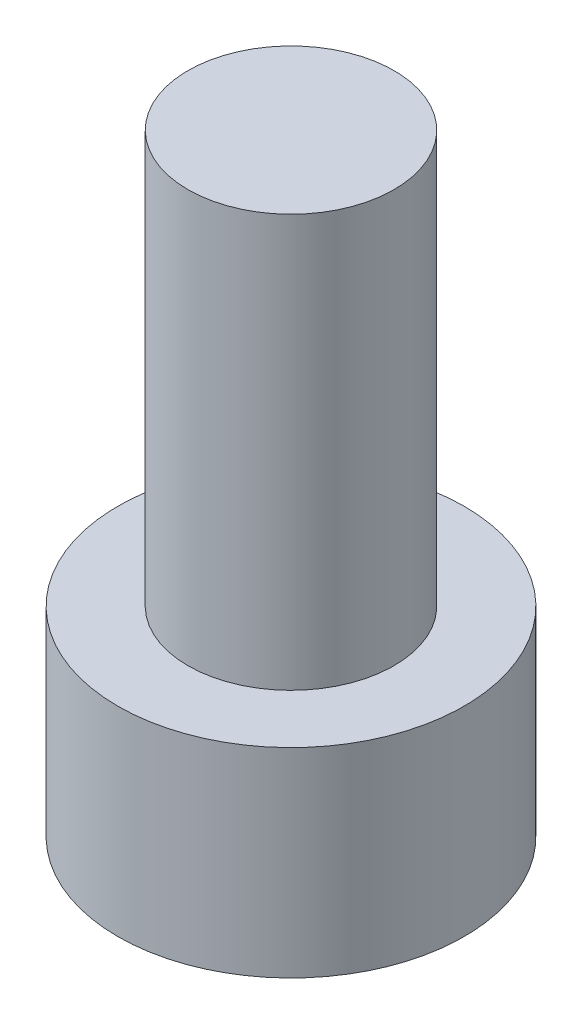
ISO-10303-21;
HEADER;
FILE_DESCRIPTION(('STEP AP214'),'2;1');
FILE_NAME('part.step','',(''),(''),'','','');
FILE_SCHEMA(('AUTOMOTIVE_DESIGN { 1 0 10303 214 1 1 1 1 }'));
ENDSEC;
DATA;
#1=APPLICATION_CONTEXT('core data for automotive mechanical design processes');
#2=APPLICATION_PROTOCOL_DEFINITION('international standard','automotive_design',2000,#1);
#3=PRODUCT_CONTEXT('',#1,'mechanical');
#4=PRODUCT('Part','Part','',(#3));
#5=PRODUCT_RELATED_PRODUCT_CATEGORY('part','',(#4));
#6=PRODUCT_DEFINITION_FORMATION('','',#4);
#7=PRODUCT_DEFINITION_CONTEXT('part definition',#1,'design');
#8=PRODUCT_DEFINITION('design','',#6,#7);
#9=PRODUCT_DEFINITION_SHAPE('','',#8);
#10=(LENGTH_UNIT() NAMED_UNIT(*) SI_UNIT(.MILLI.,.METRE.));
#11=(NAMED_UNIT(*) PLANE_ANGLE_UNIT() SI_UNIT($,.RADIAN.));
#12=(NAMED_UNIT(*) SI_UNIT($,.STERADIAN.) SOLID_ANGLE_UNIT());
#13=UNCERTAINTY_MEASURE_WITH_UNIT(LENGTH_MEASURE(1.E-05),#10,'distance_accuracy_value','');
#14=(GEOMETRIC_REPRESENTATION_CONTEXT(3) GLOBAL_UNCERTAINTY_ASSIGNED_CONTEXT((#13)) GLOBAL_UNIT_ASSIGNED_CONTEXT((#10,
#11,#12)) REPRESENTATION_CONTEXT('',''));
#15=CARTESIAN_POINT('',(0.,0.,0.));
#16=DIRECTION('',(0.,0.,1.));
#17=DIRECTION('',(1.,0.,0.));
#18=AXIS2_PLACEMENT_3D('',#15,#16,#17);
#19=CARTESIAN_POINT('',(0.,4.84,0.));
#20=DIRECTION('',(0.,-1.,0.));
#21=DIRECTION('',(0.,0.,-1.));
#22=AXIS2_PLACEMENT_3D('',#19,#20,#21);
#23=CYLINDRICAL_SURFACE('',#22,4.2);
#24=CARTESIAN_POINT('',(0.,4.84,0.));
#25=DIRECTION('',(0.,1.,0.));
#26=DIRECTION('',(0.,0.,1.));
#27=AXIS2_PLACEMENT_3D('',#24,#25,#26);
#28=CIRCLE('',#27,4.2);
#29=CARTESIAN_POINT('',(0.,4.84,4.2));
#30=VERTEX_POINT('',#29);
#31=EDGE_CURVE('E43',#30,#30,#28,.T.);
#32=ORIENTED_EDGE('',*,*,#31,.F.);
#33=EDGE_LOOP('',(#32));
#34=FACE_BOUND('',#33,.T.);
#35=CARTESIAN_POINT('',(0.,0.,0.));
#36=DIRECTION('',(0.,1.,0.));
#37=DIRECTION('',(0.,0.,1.));
#38=AXIS2_PLACEMENT_3D('',#35,#36,#37);
#39=CIRCLE('',#38,4.2);
#40=CARTESIAN_POINT('',(0.,0.,4.2));
#41=VERTEX_POINT('',#40);
#42=EDGE_CURVE('E38',#41,#41,#39,.T.);
#43=ORIENTED_EDGE('',*,*,#42,.T.);
#44=EDGE_LOOP('',(#43));
#45=FACE_BOUND('',#44,.T.);
#46=ADVANCED_FACE('F35',(#34,#45),#23,.T.);
#47=CARTESIAN_POINT('',(0.,4.84,0.));
#48=DIRECTION('',(0.,1.,0.));
#49=DIRECTION('',(0.,0.,1.));
#50=AXIS2_PLACEMENT_3D('',#47,#48,#49);
#51=PLANE('',#50);
#52=CARTESIAN_POINT('',(0.,4.84,0.));
#53=DIRECTION('',(0.,1.,0.));
#54=DIRECTION('',(0.,0.,1.));
#55=AXIS2_PLACEMENT_3D('',#52,#53,#54);
#56=CIRCLE('',#55,2.5);
#57=CARTESIAN_POINT('',(0.,4.84,2.5));
#58=VERTEX_POINT('',#57);
#59=EDGE_CURVE('E11',#58,#58,#56,.T.);
#60=ORIENTED_EDGE('',*,*,#59,.F.);
#61=EDGE_LOOP('',(#60));
#62=FACE_BOUND('',#61,.T.);
#63=ORIENTED_EDGE('',*,*,#31,.T.);
#64=EDGE_LOOP('',(#63));
#65=FACE_BOUND('',#64,.T.);
#66=ADVANCED_FACE('F155',(#62,#65),#51,.T.);
#67=CARTESIAN_POINT('',(0.,0.,0.));
#68=DIRECTION('',(0.,1.,0.));
#69=DIRECTION('',(0.,0.,1.));
#70=AXIS2_PLACEMENT_3D('',#67,#68,#69);
#71=PLANE('',#70);
#72=DIRECTION('',(-0.5,0.,0.866025403784439));
#73=VECTOR('',#72,1.);
#74=CARTESIAN_POINT('',(2.3,0.,0.));
#75=LINE('',#74,#73);
#76=CARTESIAN_POINT('',(2.3,0.,0.));
#77=VERTEX_POINT('',#76);
#78=CARTESIAN_POINT('',(1.15,0.,1.99185842870421));
#79=VERTEX_POINT('',#78);
#80=EDGE_CURVE('E125',#77,#79,#75,.T.);
#81=ORIENTED_EDGE('',*,*,#80,.F.);
#82=DIRECTION('',(0.5,0.,0.866025403784439));
#83=VECTOR('',#82,1.);
#84=CARTESIAN_POINT('',(1.15,0.,-1.99185842870421));
#85=LINE('',#84,#83);
#86=CARTESIAN_POINT('',(1.15,0.,-1.99185842870421));
#87=VERTEX_POINT('',#86);
#88=EDGE_CURVE('E51',#87,#77,#85,.T.);
#89=ORIENTED_EDGE('',*,*,#88,.F.);
#90=DIRECTION('',(1.,0.,0.));
#91=VECTOR('',#90,1.);
#92=CARTESIAN_POINT('',(-1.15,0.,-1.99185842870421));
#93=LINE('',#92,#91);
#94=CARTESIAN_POINT('',(-1.15,0.,-1.99185842870421));
#95=VERTEX_POINT('',#94);
#96=EDGE_CURVE('E134',#95,#87,#93,.T.);
#97=ORIENTED_EDGE('',*,*,#96,.F.);
#98=DIRECTION('',(0.5,0.,-0.866025403784439));
#99=VECTOR('',#98,1.);
#100=CARTESIAN_POINT('',(-2.3,0.,0.));
#101=LINE('',#100,#99);
#102=CARTESIAN_POINT('',(-2.3,0.,0.));
#103=VERTEX_POINT('',#102);
#104=EDGE_CURVE('E132',#103,#95,#101,.T.);
#105=ORIENTED_EDGE('',*,*,#104,.F.);
#106=DIRECTION('',(-0.5,0.,-0.866025403784439));
#107=VECTOR('',#106,1.);
#108=CARTESIAN_POINT('',(-1.15,0.,1.99185842870421));
#109=LINE('',#108,#107);
#110=CARTESIAN_POINT('',(-1.15,0.,1.99185842870421));
#111=VERTEX_POINT('',#110);
#112=EDGE_CURVE('E99',#111,#103,#109,.T.);
#113=ORIENTED_EDGE('',*,*,#112,.F.);
#114=DIRECTION('',(-1.,0.,0.));
#115=VECTOR('',#114,1.);
#116=CARTESIAN_POINT('',(1.15,0.,1.99185842870421));
#117=LINE('',#116,#115);
#118=EDGE_CURVE('E128',#79,#111,#117,.T.);
#119=ORIENTED_EDGE('',*,*,#118,.F.);
#120=EDGE_LOOP('',(#81,#89,#97,#105,#113,#119));
#121=FACE_BOUND('',#120,.T.);
#122=ORIENTED_EDGE('',*,*,#42,.F.);
#123=EDGE_LOOP('',(#122));
#124=FACE_BOUND('',#123,.T.);
#125=ADVANCED_FACE('F152',(#121,#124),#71,.F.);
#126=CARTESIAN_POINT('',(0.,14.84,0.));
#127=DIRECTION('',(0.,-1.,0.));
#128=DIRECTION('',(0.,0.,-1.));
#129=AXIS2_PLACEMENT_3D('',#126,#127,#128);
#130=CYLINDRICAL_SURFACE('',#129,2.5);
#131=CARTESIAN_POINT('',(0.,14.84,0.));
#132=DIRECTION('',(0.,1.,0.));
#133=DIRECTION('',(0.,0.,1.));
#134=AXIS2_PLACEMENT_3D('',#131,#132,#133);
#135=CIRCLE('',#134,2.5);
#136=CARTESIAN_POINT('',(0.,14.84,2.5));
#137=VERTEX_POINT('',#136);
#138=EDGE_CURVE('E138',#137,#137,#135,.T.);
#139=ORIENTED_EDGE('',*,*,#138,.F.);
#140=EDGE_LOOP('',(#139));
#141=FACE_BOUND('',#140,.T.);
#142=ORIENTED_EDGE('',*,*,#59,.T.);
#143=EDGE_LOOP('',(#142));
#144=FACE_BOUND('',#143,.T.);
#145=ADVANCED_FACE('F154',(#141,#144),#130,.T.);
#146=CARTESIAN_POINT('',(0.,14.84,0.));
#147=DIRECTION('',(0.,1.,0.));
#148=DIRECTION('',(0.,0.,1.));
#149=AXIS2_PLACEMENT_3D('',#146,#147,#148);
#150=PLANE('',#149);
#151=ORIENTED_EDGE('',*,*,#138,.T.);
#152=EDGE_LOOP('',(#151));
#153=FACE_BOUND('',#152,.T.);
#154=ADVANCED_FACE('F161',(#153),#150,.T.);
#155=CARTESIAN_POINT('',(1.15,3.4,-1.99185842870421));
#156=DIRECTION('',(0.866025403784439,0.,-0.5));
#157=DIRECTION('',(-0.5,0.,-0.866025403784439));
#158=AXIS2_PLACEMENT_3D('',#155,#156,#157);
#159=PLANE('',#158);
#160=ORIENTED_EDGE('',*,*,#88,.T.);
#161=DIRECTION('',(0.,-1.,0.));
#162=VECTOR('',#161,1.);
#163=CARTESIAN_POINT('',(2.3,3.4,0.));
#164=LINE('',#163,#162);
#165=CARTESIAN_POINT('',(2.3,3.4,0.));
#166=VERTEX_POINT('',#165);
#167=EDGE_CURVE('E81',#166,#77,#164,.T.);
#168=ORIENTED_EDGE('',*,*,#167,.F.);
#169=DIRECTION('',(0.5,0.,0.866025403784439));
#170=VECTOR('',#169,1.);
#171=CARTESIAN_POINT('',(1.15,3.4,-1.99185842870421));
#172=LINE('',#171,#170);
#173=CARTESIAN_POINT('',(1.15,3.4,-1.99185842870421));
#174=VERTEX_POINT('',#173);
#175=EDGE_CURVE('E136',#174,#166,#172,.T.);
#176=ORIENTED_EDGE('',*,*,#175,.F.);
#177=DIRECTION('',(0.,-1.,0.));
#178=VECTOR('',#177,1.);
#179=CARTESIAN_POINT('',(1.15,3.4,-1.99185842870421));
#180=LINE('',#179,#178);
#181=EDGE_CURVE('E59',#174,#87,#180,.T.);
#182=ORIENTED_EDGE('',*,*,#181,.T.);
#183=EDGE_LOOP('',(#160,#168,#176,#182));
#184=FACE_BOUND('',#183,.T.);
#185=ADVANCED_FACE('F190',(#184),#159,.F.);
#186=CARTESIAN_POINT('',(-1.15,3.4,-1.99185842870421));
#187=DIRECTION('',(0.,0.,-1.));
#188=DIRECTION('',(-1.,0.,0.));
#189=AXIS2_PLACEMENT_3D('',#186,#187,#188);
#190=PLANE('',#189);
#191=ORIENTED_EDGE('',*,*,#96,.T.);
#192=ORIENTED_EDGE('',*,*,#181,.F.);
#193=DIRECTION('',(1.,0.,0.));
#194=VECTOR('',#193,1.);
#195=CARTESIAN_POINT('',(-1.15,3.4,-1.99185842870421));
#196=LINE('',#195,#194);
#197=CARTESIAN_POINT('',(-1.15,3.4,-1.99185842870421));
#198=VERTEX_POINT('',#197);
#199=EDGE_CURVE('E111',#198,#174,#196,.T.);
#200=ORIENTED_EDGE('',*,*,#199,.F.);
#201=DIRECTION('',(0.,-1.,0.));
#202=VECTOR('',#201,1.);
#203=CARTESIAN_POINT('',(-1.15,3.4,-1.99185842870421));
#204=LINE('',#203,#202);
#205=EDGE_CURVE('E103',#198,#95,#204,.T.);
#206=ORIENTED_EDGE('',*,*,#205,.T.);
#207=EDGE_LOOP('',(#191,#192,#200,#206));
#208=FACE_BOUND('',#207,.T.);
#209=ADVANCED_FACE('F204',(#208),#190,.F.);
#210=CARTESIAN_POINT('',(-2.3,3.4,0.));
#211=DIRECTION('',(-0.866025403784439,0.,-0.5));
#212=DIRECTION('',(-0.5,0.,0.866025403784439));
#213=AXIS2_PLACEMENT_3D('',#210,#211,#212);
#214=PLANE('',#213);
#215=ORIENTED_EDGE('',*,*,#104,.T.);
#216=ORIENTED_EDGE('',*,*,#205,.F.);
#217=DIRECTION('',(0.5,0.,-0.866025403784439));
#218=VECTOR('',#217,1.);
#219=CARTESIAN_POINT('',(-2.3,3.4,0.));
#220=LINE('',#219,#218);
#221=CARTESIAN_POINT('',(-2.3,3.4,0.));
#222=VERTEX_POINT('',#221);
#223=EDGE_CURVE('E107',#222,#198,#220,.T.);
#224=ORIENTED_EDGE('',*,*,#223,.F.);
#225=DIRECTION('',(0.,-1.,0.));
#226=VECTOR('',#225,1.);
#227=CARTESIAN_POINT('',(-2.3,3.4,0.));
#228=LINE('',#227,#226);
#229=EDGE_CURVE('E92',#222,#103,#228,.T.);
#230=ORIENTED_EDGE('',*,*,#229,.T.);
#231=EDGE_LOOP('',(#215,#216,#224,#230));
#232=FACE_BOUND('',#231,.T.);
#233=ADVANCED_FACE('F108',(#232),#214,.F.);
#234=CARTESIAN_POINT('',(-1.15,3.4,1.99185842870421));
#235=DIRECTION('',(-0.866025403784439,0.,0.5));
#236=DIRECTION('',(0.5,0.,0.866025403784439));
#237=AXIS2_PLACEMENT_3D('',#234,#235,#236);
#238=PLANE('',#237);
#239=ORIENTED_EDGE('',*,*,#112,.T.);
#240=ORIENTED_EDGE('',*,*,#229,.F.);
#241=DIRECTION('',(-0.5,0.,-0.866025403784439));
#242=VECTOR('',#241,1.);
#243=CARTESIAN_POINT('',(-1.15,3.4,1.99185842870421));
#244=LINE('',#243,#242);
#245=CARTESIAN_POINT('',(-1.15,3.4,1.99185842870421));
#246=VERTEX_POINT('',#245);
#247=EDGE_CURVE('E96',#246,#222,#244,.T.);
#248=ORIENTED_EDGE('',*,*,#247,.F.);
#249=DIRECTION('',(0.,-1.,0.));
#250=VECTOR('',#249,1.);
#251=CARTESIAN_POINT('',(-1.15,3.4,1.99185842870421));
#252=LINE('',#251,#250);
#253=EDGE_CURVE('E104',#246,#111,#252,.T.);
#254=ORIENTED_EDGE('',*,*,#253,.T.);
#255=EDGE_LOOP('',(#239,#240,#248,#254));
#256=FACE_BOUND('',#255,.T.);
#257=ADVANCED_FACE('F94',(#256),#238,.F.);
#258=CARTESIAN_POINT('',(1.15,3.4,1.99185842870421));
#259=DIRECTION('',(0.,0.,1.));
#260=DIRECTION('',(1.,0.,0.));
#261=AXIS2_PLACEMENT_3D('',#258,#259,#260);
#262=PLANE('',#261);
#263=ORIENTED_EDGE('',*,*,#118,.T.);
#264=ORIENTED_EDGE('',*,*,#253,.F.);
#265=DIRECTION('',(-1.,0.,0.));
#266=VECTOR('',#265,1.);
#267=CARTESIAN_POINT('',(1.15,3.4,1.99185842870421));
#268=LINE('',#267,#266);
#269=CARTESIAN_POINT('',(1.15,3.4,1.99185842870421));
#270=VERTEX_POINT('',#269);
#271=EDGE_CURVE('E117',#270,#246,#268,.T.);
#272=ORIENTED_EDGE('',*,*,#271,.F.);
#273=DIRECTION('',(0.,-1.,0.));
#274=VECTOR('',#273,1.);
#275=CARTESIAN_POINT('',(1.15,3.4,1.99185842870421));
#276=LINE('',#275,#274);
#277=EDGE_CURVE('E141',#270,#79,#276,.T.);
#278=ORIENTED_EDGE('',*,*,#277,.T.);
#279=EDGE_LOOP('',(#263,#264,#272,#278));
#280=FACE_BOUND('',#279,.T.);
#281=ADVANCED_FACE('F229',(#280),#262,.F.);
#282=CARTESIAN_POINT('',(2.3,3.4,0.));
#283=DIRECTION('',(0.866025403784439,0.,0.5));
#284=DIRECTION('',(0.5,0.,-0.866025403784439));
#285=AXIS2_PLACEMENT_3D('',#282,#283,#284);
#286=PLANE('',#285);
#287=ORIENTED_EDGE('',*,*,#80,.T.);
#288=ORIENTED_EDGE('',*,*,#277,.F.);
#289=DIRECTION('',(-0.5,0.,0.866025403784439));
#290=VECTOR('',#289,1.);
#291=CARTESIAN_POINT('',(2.3,3.4,0.));
#292=LINE('',#291,#290);
#293=EDGE_CURVE('E119',#166,#270,#292,.T.);
#294=ORIENTED_EDGE('',*,*,#293,.F.);
#295=ORIENTED_EDGE('',*,*,#167,.T.);
#296=EDGE_LOOP('',(#287,#288,#294,#295));
#297=FACE_BOUND('',#296,.T.);
#298=ADVANCED_FACE('F238',(#297),#286,.F.);
#299=CARTESIAN_POINT('',(0.,3.4,0.));
#300=DIRECTION('',(0.,-1.,0.));
#301=DIRECTION('',(0.,0.,-1.));
#302=AXIS2_PLACEMENT_3D('',#299,#300,#301);
#303=PLANE('',#302);
#304=ORIENTED_EDGE('',*,*,#175,.T.);
#305=ORIENTED_EDGE('',*,*,#293,.T.);
#306=ORIENTED_EDGE('',*,*,#271,.T.);
#307=ORIENTED_EDGE('',*,*,#247,.T.);
#308=ORIENTED_EDGE('',*,*,#223,.T.);
#309=ORIENTED_EDGE('',*,*,#199,.T.);
#310=EDGE_LOOP('',(#304,#305,#306,#307,#308,#309));
#311=FACE_BOUND('',#310,.T.);
#312=ADVANCED_FACE('F114',(#311),#303,.T.);
#313=CLOSED_SHELL('',(#46,#66,#125,#145,#154,#185,#209,#233,#257,#281,#298,#312));
#314=MANIFOLD_SOLID_BREP('B2',#313);
#315=ADVANCED_BREP_SHAPE_REPRESENTATION('',(#18,#314),#14);
#316=SHAPE_DEFINITION_REPRESENTATION(#9,#315);
ENDSEC;
END-ISO-10303-21;
